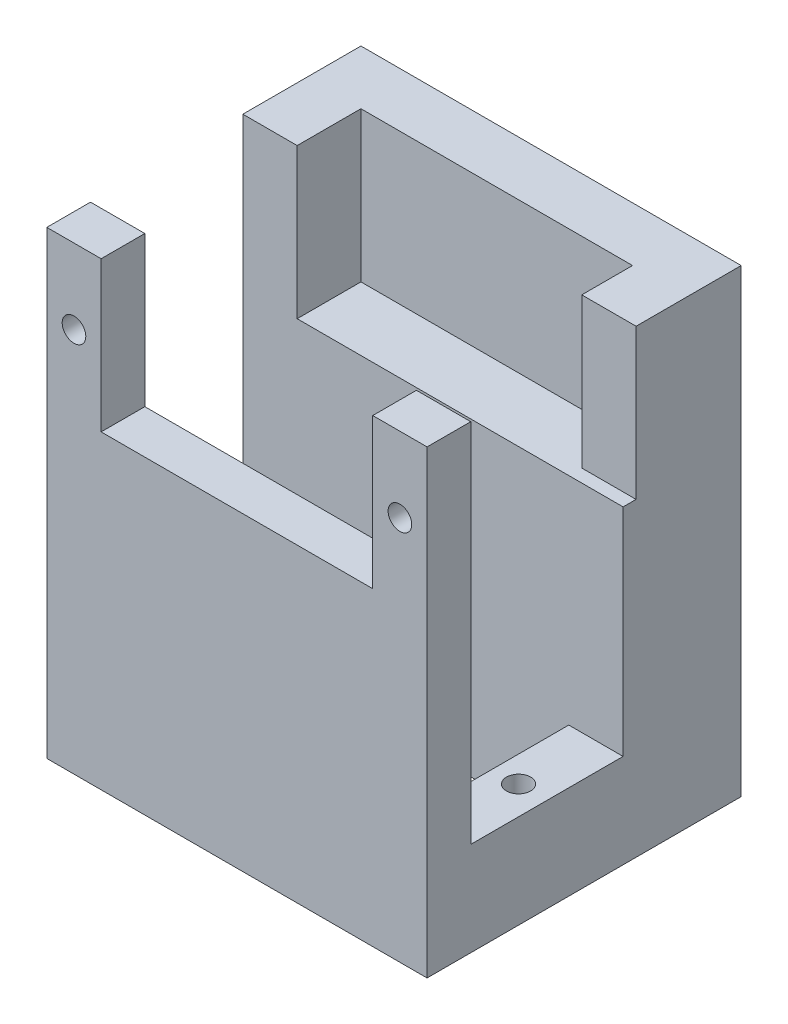
ISO-10303-21;
HEADER;
FILE_DESCRIPTION(('STEP AP214'),'2;1');
FILE_NAME('part.step','',(''),(''),'','','');
FILE_SCHEMA(('AUTOMOTIVE_DESIGN { 1 0 10303 214 1 1 1 1 }'));
ENDSEC;
DATA;
#1=APPLICATION_CONTEXT('core data for automotive mechanical design processes');
#2=APPLICATION_PROTOCOL_DEFINITION('international standard','automotive_design',2000,#1);
#3=PRODUCT_CONTEXT('',#1,'mechanical');
#4=PRODUCT('Part','Part','',(#3));
#5=PRODUCT_RELATED_PRODUCT_CATEGORY('part','',(#4));
#6=PRODUCT_DEFINITION_FORMATION('','',#4);
#7=PRODUCT_DEFINITION_CONTEXT('part definition',#1,'design');
#8=PRODUCT_DEFINITION('design','',#6,#7);
#9=PRODUCT_DEFINITION_SHAPE('','',#8);
#10=(LENGTH_UNIT() NAMED_UNIT(*) SI_UNIT(.MILLI.,.METRE.));
#11=(NAMED_UNIT(*) PLANE_ANGLE_UNIT() SI_UNIT($,.RADIAN.));
#12=(NAMED_UNIT(*) SI_UNIT($,.STERADIAN.) SOLID_ANGLE_UNIT());
#13=UNCERTAINTY_MEASURE_WITH_UNIT(LENGTH_MEASURE(1.E-05),#10,'distance_accuracy_value','');
#14=(GEOMETRIC_REPRESENTATION_CONTEXT(3) GLOBAL_UNCERTAINTY_ASSIGNED_CONTEXT((#13)) GLOBAL_UNIT_ASSIGNED_CONTEXT((#10,
#11,#12)) REPRESENTATION_CONTEXT('',''));
#15=CARTESIAN_POINT('',(0.,0.,0.));
#16=DIRECTION('',(0.,0.,1.));
#17=DIRECTION('',(1.,0.,0.));
#18=AXIS2_PLACEMENT_3D('',#15,#16,#17);
#19=CARTESIAN_POINT('',(0.,22.,0.));
#20=DIRECTION('',(0.,1.,0.));
#21=DIRECTION('',(0.,0.,1.));
#22=AXIS2_PLACEMENT_3D('',#19,#20,#21);
#23=PLANE('',#22);
#24=DIRECTION('',(1.,0.,0.));
#25=VECTOR('',#24,1.);
#26=CARTESIAN_POINT('',(-21.15,22.,10.15));
#27=LINE('',#26,#25);
#28=CARTESIAN_POINT('',(-16.55,22.,10.15));
#29=VERTEX_POINT('',#28);
#30=CARTESIAN_POINT('',(6.45,22.,10.15));
#31=VERTEX_POINT('',#30);
#32=EDGE_CURVE('E55',#29,#31,#27,.T.);
#33=ORIENTED_EDGE('',*,*,#32,.T.);
#34=DIRECTION('',(0.,0.,1.));
#35=VECTOR('',#34,1.);
#36=CARTESIAN_POINT('',(6.45,22.,10.15));
#37=LINE('',#36,#35);
#38=CARTESIAN_POINT('',(6.45,22.,6.45));
#39=VERTEX_POINT('',#38);
#40=EDGE_CURVE('E50',#39,#31,#37,.T.);
#41=ORIENTED_EDGE('',*,*,#40,.F.);
#42=DIRECTION('',(-1.,0.,0.));
#43=VECTOR('',#42,1.);
#44=CARTESIAN_POINT('',(-21.15,22.,6.45));
#45=LINE('',#44,#43);
#46=CARTESIAN_POINT('',(-16.55,22.,6.45));
#47=VERTEX_POINT('',#46);
#48=EDGE_CURVE('E293',#39,#47,#45,.T.);
#49=ORIENTED_EDGE('',*,*,#48,.T.);
#50=DIRECTION('',(0.,0.,-1.));
#51=VECTOR('',#50,1.);
#52=CARTESIAN_POINT('',(-16.55,22.,10.15));
#53=LINE('',#52,#51);
#54=EDGE_CURVE('E226',#29,#47,#53,.T.);
#55=ORIENTED_EDGE('',*,*,#54,.F.);
#56=EDGE_LOOP('',(#33,#41,#49,#55));
#57=FACE_BOUND('',#56,.T.);
#58=ADVANCED_FACE('F35',(#57),#23,.T.);
#59=CARTESIAN_POINT('',(0.,22.,0.));
#60=DIRECTION('',(0.,1.,0.));
#61=DIRECTION('',(0.,0.,1.));
#62=AXIS2_PLACEMENT_3D('',#59,#60,#61);
#63=PLANE('',#62);
#64=DIRECTION('',(1.,0.,0.));
#65=VECTOR('',#64,1.);
#66=CARTESIAN_POINT('',(-16.55,22.,-11.85));
#67=LINE('',#66,#65);
#68=CARTESIAN_POINT('',(-16.55,22.,-11.85));
#69=VERTEX_POINT('',#68);
#70=CARTESIAN_POINT('',(6.45,22.,-11.85));
#71=VERTEX_POINT('',#70);
#72=EDGE_CURVE('E269',#69,#71,#67,.T.);
#73=ORIENTED_EDGE('',*,*,#72,.F.);
#74=DIRECTION('',(0.,0.,-1.));
#75=VECTOR('',#74,1.);
#76=CARTESIAN_POINT('',(-16.55,22.,-11.85));
#77=LINE('',#76,#75);
#78=CARTESIAN_POINT('',(-16.55,22.,-6.45));
#79=VERTEX_POINT('',#78);
#80=EDGE_CURVE('E245',#79,#69,#77,.T.);
#81=ORIENTED_EDGE('',*,*,#80,.F.);
#82=DIRECTION('',(1.,0.,0.));
#83=VECTOR('',#82,1.);
#84=CARTESIAN_POINT('',(-21.15,22.,-6.45));
#85=LINE('',#84,#83);
#86=CARTESIAN_POINT('',(11.05,22.,-6.45));
#87=VERTEX_POINT('',#86);
#88=EDGE_CURVE('E298',#79,#87,#85,.T.);
#89=ORIENTED_EDGE('',*,*,#88,.T.);
#90=DIRECTION('',(0.,0.,-1.));
#91=VECTOR('',#90,1.);
#92=CARTESIAN_POINT('',(11.05,22.,-16.45));
#93=LINE('',#92,#91);
#94=CARTESIAN_POINT('',(11.05,22.,-7.55));
#95=VERTEX_POINT('',#94);
#96=EDGE_CURVE('E300',#87,#95,#93,.T.);
#97=ORIENTED_EDGE('',*,*,#96,.T.);
#98=DIRECTION('',(1.,0.,0.));
#99=VECTOR('',#98,1.);
#100=CARTESIAN_POINT('',(11.05,22.,-7.55));
#101=LINE('',#100,#99);
#102=CARTESIAN_POINT('',(6.45,22.,-7.55));
#103=VERTEX_POINT('',#102);
#104=EDGE_CURVE('E250',#103,#95,#101,.T.);
#105=ORIENTED_EDGE('',*,*,#104,.F.);
#106=DIRECTION('',(0.,0.,1.));
#107=VECTOR('',#106,1.);
#108=CARTESIAN_POINT('',(6.45,22.,-11.85));
#109=LINE('',#108,#107);
#110=EDGE_CURVE('E272',#71,#103,#109,.T.);
#111=ORIENTED_EDGE('',*,*,#110,.F.);
#112=EDGE_LOOP('',(#73,#81,#89,#97,#105,#111));
#113=FACE_BOUND('',#112,.T.);
#114=ADVANCED_FACE('F447',(#113),#63,.T.);
#115=CARTESIAN_POINT('',(0.,3.7,0.));
#116=DIRECTION('',(0.,1.,0.));
#117=DIRECTION('',(0.,0.,1.));
#118=AXIS2_PLACEMENT_3D('',#115,#116,#117);
#119=PLANE('',#118);
#120=CARTESIAN_POINT('',(-18.75,3.7,0.));
#121=DIRECTION('',(0.,1.,0.));
#122=DIRECTION('',(0.,0.,1.));
#123=AXIS2_PLACEMENT_3D('',#120,#121,#122);
#124=CIRCLE('',#123,1.025);
#125=CARTESIAN_POINT('',(-18.75,3.7,1.02500000000005));
#126=VERTEX_POINT('',#125);
#127=EDGE_CURVE('E314',#126,#126,#124,.T.);
#128=ORIENTED_EDGE('',*,*,#127,.F.);
#129=EDGE_LOOP('',(#128));
#130=FACE_BOUND('',#129,.T.);
#131=DIRECTION('',(0.,0.,1.));
#132=VECTOR('',#131,1.);
#133=CARTESIAN_POINT('',(-21.15,3.7,0.));
#134=LINE('',#133,#132);
#135=CARTESIAN_POINT('',(-21.15,3.7,-6.45));
#136=VERTEX_POINT('',#135);
#137=CARTESIAN_POINT('',(-21.15,3.7,6.45));
#138=VERTEX_POINT('',#137);
#139=EDGE_CURVE('E329',#136,#138,#134,.T.);
#140=ORIENTED_EDGE('',*,*,#139,.T.);
#141=DIRECTION('',(1.,0.,0.));
#142=VECTOR('',#141,1.);
#143=CARTESIAN_POINT('',(0.,3.7,6.45));
#144=LINE('',#143,#142);
#145=CARTESIAN_POINT('',(-16.55,3.7,6.45));
#146=VERTEX_POINT('',#145);
#147=EDGE_CURVE('E11',#138,#146,#144,.T.);
#148=ORIENTED_EDGE('',*,*,#147,.T.);
#149=DIRECTION('',(0.,0.,1.));
#150=VECTOR('',#149,1.);
#151=CARTESIAN_POINT('',(-16.55,3.7,0.));
#152=LINE('',#151,#150);
#153=CARTESIAN_POINT('',(-16.55,3.7,-6.45));
#154=VERTEX_POINT('',#153);
#155=EDGE_CURVE('E322',#154,#146,#152,.T.);
#156=ORIENTED_EDGE('',*,*,#155,.F.);
#157=DIRECTION('',(1.,0.,0.));
#158=VECTOR('',#157,1.);
#159=CARTESIAN_POINT('',(-21.15,3.7,-6.45));
#160=LINE('',#159,#158);
#161=EDGE_CURVE('E197',#136,#154,#160,.T.);
#162=ORIENTED_EDGE('',*,*,#161,.F.);
#163=EDGE_LOOP('',(#140,#148,#156,#162));
#164=FACE_BOUND('',#163,.T.);
#165=ADVANCED_FACE('F406',(#130,#164),#119,.T.);
#166=CARTESIAN_POINT('',(8.65,3.7,0.));
#167=DIRECTION('',(0.,1.,0.));
#168=DIRECTION('',(0.,0.,1.));
#169=AXIS2_PLACEMENT_3D('',#166,#167,#168);
#170=CIRCLE('',#169,1.025);
#171=CARTESIAN_POINT('',(8.65,3.7,1.02500000000005));
#172=VERTEX_POINT('',#171);
#173=EDGE_CURVE('E317',#172,#172,#170,.T.);
#174=ORIENTED_EDGE('',*,*,#173,.F.);
#175=EDGE_LOOP('',(#174));
#176=FACE_BOUND('',#175,.T.);
#177=DIRECTION('',(0.,0.,1.));
#178=VECTOR('',#177,1.);
#179=CARTESIAN_POINT('',(6.45,3.7,0.));
#180=LINE('',#179,#178);
#181=CARTESIAN_POINT('',(6.45,3.7,-6.45));
#182=VERTEX_POINT('',#181);
#183=CARTESIAN_POINT('',(6.45,3.7,6.45));
#184=VERTEX_POINT('',#183);
#185=EDGE_CURVE('E325',#182,#184,#180,.T.);
#186=ORIENTED_EDGE('',*,*,#185,.T.);
#187=DIRECTION('',(-1.,0.,0.));
#188=VECTOR('',#187,1.);
#189=CARTESIAN_POINT('',(-21.15,3.7,6.45));
#190=LINE('',#189,#188);
#191=CARTESIAN_POINT('',(11.05,3.7,6.45));
#192=VERTEX_POINT('',#191);
#193=EDGE_CURVE('E291',#192,#184,#190,.T.);
#194=ORIENTED_EDGE('',*,*,#193,.F.);
#195=DIRECTION('',(0.,0.,1.));
#196=VECTOR('',#195,1.);
#197=CARTESIAN_POINT('',(11.05,3.7,0.));
#198=LINE('',#197,#196);
#199=CARTESIAN_POINT('',(11.05,3.7,-6.45));
#200=VERTEX_POINT('',#199);
#201=EDGE_CURVE('E194',#200,#192,#198,.T.);
#202=ORIENTED_EDGE('',*,*,#201,.F.);
#203=EDGE_CURVE('E43',#182,#200,#160,.T.);
#204=ORIENTED_EDGE('',*,*,#203,.F.);
#205=EDGE_LOOP('',(#186,#194,#202,#204));
#206=FACE_BOUND('',#205,.T.);
#207=ADVANCED_FACE('F476',(#176,#206),#119,.T.);
#208=CARTESIAN_POINT('',(0.,0.,0.));
#209=DIRECTION('',(0.,1.,0.));
#210=DIRECTION('',(0.,0.,1.));
#211=AXIS2_PLACEMENT_3D('',#208,#209,#210);
#212=PLANE('',#211);
#213=DIRECTION('',(0.,0.,1.));
#214=VECTOR('',#213,1.);
#215=CARTESIAN_POINT('',(-16.55,0.,0.));
#216=LINE('',#215,#214);
#217=CARTESIAN_POINT('',(-16.55,0.,-6.45));
#218=VERTEX_POINT('',#217);
#219=CARTESIAN_POINT('',(-16.55,0.,6.45));
#220=VERTEX_POINT('',#219);
#221=EDGE_CURVE('E335',#218,#220,#216,.T.);
#222=ORIENTED_EDGE('',*,*,#221,.T.);
#223=DIRECTION('',(1.,0.,0.));
#224=VECTOR('',#223,1.);
#225=CARTESIAN_POINT('',(0.,0.,6.45));
#226=LINE('',#225,#224);
#227=CARTESIAN_POINT('',(-9.05,0.,6.45));
#228=VERTEX_POINT('',#227);
#229=EDGE_CURVE('E313',#220,#228,#226,.T.);
#230=ORIENTED_EDGE('',*,*,#229,.T.);
#231=DIRECTION('',(0.,0.,1.));
#232=VECTOR('',#231,1.);
#233=CARTESIAN_POINT('',(-9.05,0.,0.));
#234=LINE('',#233,#232);
#235=CARTESIAN_POINT('',(-9.05,0.,-6.45));
#236=VERTEX_POINT('',#235);
#237=EDGE_CURVE('E343',#236,#228,#234,.T.);
#238=ORIENTED_EDGE('',*,*,#237,.F.);
#239=DIRECTION('',(1.,0.,0.));
#240=VECTOR('',#239,1.);
#241=CARTESIAN_POINT('',(0.,0.,-6.45));
#242=LINE('',#241,#240);
#243=EDGE_CURVE('E326',#218,#236,#242,.T.);
#244=ORIENTED_EDGE('',*,*,#243,.F.);
#245=EDGE_LOOP('',(#222,#230,#238,#244));
#246=FACE_BOUND('',#245,.T.);
#247=ADVANCED_FACE('F395',(#246),#212,.T.);
#248=CARTESIAN_POINT('',(-21.15,-4.25,0.));
#249=DIRECTION('',(-1.,0.,0.));
#250=DIRECTION('',(0.,0.,1.));
#251=AXIS2_PLACEMENT_3D('',#248,#249,#250);
#252=PLANE('',#251);
#253=DIRECTION('',(0.,1.,0.));
#254=VECTOR('',#253,1.);
#255=CARTESIAN_POINT('',(-21.15,-4.25,10.15));
#256=LINE('',#255,#254);
#257=CARTESIAN_POINT('',(-21.15,-4.25,10.15));
#258=VERTEX_POINT('',#257);
#259=CARTESIAN_POINT('',(-21.15,34.7,10.15));
#260=VERTEX_POINT('',#259);
#261=EDGE_CURVE('E374',#258,#260,#256,.T.);
#262=ORIENTED_EDGE('',*,*,#261,.T.);
#263=DIRECTION('',(0.,0.,1.));
#264=VECTOR('',#263,1.);
#265=CARTESIAN_POINT('',(-21.15,34.7,10.15));
#266=LINE('',#265,#264);
#267=CARTESIAN_POINT('',(-21.15,34.7,6.45));
#268=VERTEX_POINT('',#267);
#269=EDGE_CURVE('E227',#268,#260,#266,.T.);
#270=ORIENTED_EDGE('',*,*,#269,.F.);
#271=DIRECTION('',(0.,-1.,0.));
#272=VECTOR('',#271,1.);
#273=CARTESIAN_POINT('',(-21.15,22.,6.45));
#274=LINE('',#273,#272);
#275=EDGE_CURVE('E198',#268,#138,#274,.T.);
#276=ORIENTED_EDGE('',*,*,#275,.T.);
#277=ORIENTED_EDGE('',*,*,#139,.F.);
#278=DIRECTION('',(0.,-1.,0.));
#279=VECTOR('',#278,1.);
#280=CARTESIAN_POINT('',(-21.15,22.,-6.45));
#281=LINE('',#280,#279);
#282=CARTESIAN_POINT('',(-21.15,34.7,-6.45));
#283=VERTEX_POINT('',#282);
#284=EDGE_CURVE('E306',#283,#136,#281,.T.);
#285=ORIENTED_EDGE('',*,*,#284,.F.);
#286=DIRECTION('',(0.,0.,1.));
#287=VECTOR('',#286,1.);
#288=CARTESIAN_POINT('',(-21.15,34.7,-16.45));
#289=LINE('',#288,#287);
#290=CARTESIAN_POINT('',(-21.15,34.7,-16.45));
#291=VERTEX_POINT('',#290);
#292=EDGE_CURVE('E246',#291,#283,#289,.T.);
#293=ORIENTED_EDGE('',*,*,#292,.F.);
#294=DIRECTION('',(0.,1.,0.));
#295=VECTOR('',#294,1.);
#296=CARTESIAN_POINT('',(-21.15,-4.25,-16.45));
#297=LINE('',#296,#295);
#298=CARTESIAN_POINT('',(-21.15,-4.25,-16.45));
#299=VERTEX_POINT('',#298);
#300=EDGE_CURVE('E368',#299,#291,#297,.T.);
#301=ORIENTED_EDGE('',*,*,#300,.F.);
#302=DIRECTION('',(0.,0.,1.));
#303=VECTOR('',#302,1.);
#304=CARTESIAN_POINT('',(-21.15,-4.25,0.));
#305=LINE('',#304,#303);
#306=EDGE_CURVE('E354',#299,#258,#305,.T.);
#307=ORIENTED_EDGE('',*,*,#306,.T.);
#308=EDGE_LOOP('',(#262,#270,#276,#277,#285,#293,#301,#307));
#309=FACE_BOUND('',#308,.T.);
#310=ADVANCED_FACE('F405',(#309),#252,.T.);
#311=CARTESIAN_POINT('',(0.,-4.25,-16.45));
#312=DIRECTION('',(0.,0.,1.));
#313=DIRECTION('',(1.,0.,0.));
#314=AXIS2_PLACEMENT_3D('',#311,#312,#313);
#315=PLANE('',#314);
#316=ORIENTED_EDGE('',*,*,#300,.T.);
#317=DIRECTION('',(-1.,0.,0.));
#318=VECTOR('',#317,1.);
#319=CARTESIAN_POINT('',(11.05,34.7,-16.45));
#320=LINE('',#319,#318);
#321=CARTESIAN_POINT('',(11.05,34.7,-16.45));
#322=VERTEX_POINT('',#321);
#323=EDGE_CURVE('E263',#322,#291,#320,.T.);
#324=ORIENTED_EDGE('',*,*,#323,.F.);
#325=DIRECTION('',(0.,1.,0.));
#326=VECTOR('',#325,1.);
#327=CARTESIAN_POINT('',(11.05,-4.25,-16.45));
#328=LINE('',#327,#326);
#329=CARTESIAN_POINT('',(11.05,-4.25,-16.45));
#330=VERTEX_POINT('',#329);
#331=EDGE_CURVE('E370',#330,#322,#328,.T.);
#332=ORIENTED_EDGE('',*,*,#331,.F.);
#333=DIRECTION('',(1.,0.,0.));
#334=VECTOR('',#333,1.);
#335=CARTESIAN_POINT('',(0.,-4.25,-16.45));
#336=LINE('',#335,#334);
#337=EDGE_CURVE('E362',#299,#330,#336,.T.);
#338=ORIENTED_EDGE('',*,*,#337,.F.);
#339=EDGE_LOOP('',(#316,#324,#332,#338));
#340=FACE_BOUND('',#339,.T.);
#341=ADVANCED_FACE('F419',(#340),#315,.F.);
#342=CARTESIAN_POINT('',(11.05,-4.25,0.));
#343=DIRECTION('',(-1.,0.,0.));
#344=DIRECTION('',(0.,0.,1.));
#345=AXIS2_PLACEMENT_3D('',#342,#343,#344);
#346=PLANE('',#345);
#347=ORIENTED_EDGE('',*,*,#331,.T.);
#348=DIRECTION('',(0.,0.,-1.));
#349=VECTOR('',#348,1.);
#350=CARTESIAN_POINT('',(11.05,34.7,-16.45));
#351=LINE('',#350,#349);
#352=CARTESIAN_POINT('',(11.05,34.7,-7.55));
#353=VERTEX_POINT('',#352);
#354=EDGE_CURVE('E260',#353,#322,#351,.T.);
#355=ORIENTED_EDGE('',*,*,#354,.F.);
#356=DIRECTION('',(0.,-1.,0.));
#357=VECTOR('',#356,1.);
#358=CARTESIAN_POINT('',(11.05,34.7,-7.55));
#359=LINE('',#358,#357);
#360=EDGE_CURVE('E266',#353,#95,#359,.T.);
#361=ORIENTED_EDGE('',*,*,#360,.T.);
#362=ORIENTED_EDGE('',*,*,#96,.F.);
#363=DIRECTION('',(0.,-1.,0.));
#364=VECTOR('',#363,1.);
#365=CARTESIAN_POINT('',(11.05,22.,-6.45));
#366=LINE('',#365,#364);
#367=EDGE_CURVE('E302',#87,#200,#366,.T.);
#368=ORIENTED_EDGE('',*,*,#367,.T.);
#369=ORIENTED_EDGE('',*,*,#201,.T.);
#370=DIRECTION('',(0.,-1.,0.));
#371=VECTOR('',#370,1.);
#372=CARTESIAN_POINT('',(11.05,22.,6.45));
#373=LINE('',#372,#371);
#374=CARTESIAN_POINT('',(11.05,34.7,6.45));
#375=VERTEX_POINT('',#374);
#376=EDGE_CURVE('E187',#375,#192,#373,.T.);
#377=ORIENTED_EDGE('',*,*,#376,.F.);
#378=DIRECTION('',(0.,0.,-1.));
#379=VECTOR('',#378,1.);
#380=CARTESIAN_POINT('',(11.05,34.7,10.15));
#381=LINE('',#380,#379);
#382=CARTESIAN_POINT('',(11.05,34.7,10.15));
#383=VERTEX_POINT('',#382);
#384=EDGE_CURVE('E192',#383,#375,#381,.T.);
#385=ORIENTED_EDGE('',*,*,#384,.F.);
#386=DIRECTION('',(0.,1.,0.));
#387=VECTOR('',#386,1.);
#388=CARTESIAN_POINT('',(11.05,-4.25,10.15));
#389=LINE('',#388,#387);
#390=CARTESIAN_POINT('',(11.05,-4.25,10.15));
#391=VERTEX_POINT('',#390);
#392=EDGE_CURVE('E372',#391,#383,#389,.T.);
#393=ORIENTED_EDGE('',*,*,#392,.F.);
#394=DIRECTION('',(0.,0.,1.));
#395=VECTOR('',#394,1.);
#396=CARTESIAN_POINT('',(11.05,-4.25,0.));
#397=LINE('',#396,#395);
#398=EDGE_CURVE('E360',#330,#391,#397,.T.);
#399=ORIENTED_EDGE('',*,*,#398,.F.);
#400=EDGE_LOOP('',(#347,#355,#361,#362,#368,#369,#377,#385,#393,#399));
#401=FACE_BOUND('',#400,.T.);
#402=ADVANCED_FACE('F189',(#401),#346,.F.);
#403=CARTESIAN_POINT('',(0.,-4.25,6.45));
#404=DIRECTION('',(0.,0.,1.));
#405=DIRECTION('',(1.,0.,0.));
#406=AXIS2_PLACEMENT_3D('',#403,#404,#405);
#407=PLANE('',#406);
#408=CARTESIAN_POINT('',(-18.85,28.35,6.45));
#409=DIRECTION('',(0.,0.,1.));
#410=DIRECTION('',(1.,0.,0.));
#411=AXIS2_PLACEMENT_3D('',#408,#409,#410);
#412=CIRCLE('',#411,1.);
#413=CARTESIAN_POINT('',(-17.85,28.35,6.45));
#414=VERTEX_POINT('',#413);
#415=EDGE_CURVE('E214',#414,#414,#412,.F.);
#416=ORIENTED_EDGE('',*,*,#415,.F.);
#417=EDGE_LOOP('',(#416));
#418=FACE_BOUND('',#417,.T.);
#419=CARTESIAN_POINT('',(8.75,28.35,6.45));
#420=DIRECTION('',(0.,0.,1.));
#421=DIRECTION('',(1.,0.,0.));
#422=AXIS2_PLACEMENT_3D('',#419,#420,#421);
#423=CIRCLE('',#422,1.);
#424=CARTESIAN_POINT('',(9.75,28.35,6.45));
#425=VERTEX_POINT('',#424);
#426=EDGE_CURVE('E217',#425,#425,#423,.F.);
#427=ORIENTED_EDGE('',*,*,#426,.F.);
#428=EDGE_LOOP('',(#427));
#429=FACE_BOUND('',#428,.T.);
#430=DIRECTION('',(0.,1.,0.));
#431=VECTOR('',#430,1.);
#432=CARTESIAN_POINT('',(-9.05,-4.25,6.45));
#433=LINE('',#432,#431);
#434=CARTESIAN_POINT('',(-9.05,-4.25,6.45));
#435=VERTEX_POINT('',#434);
#436=EDGE_CURVE('E365',#435,#228,#433,.T.);
#437=ORIENTED_EDGE('',*,*,#436,.T.);
#438=ORIENTED_EDGE('',*,*,#229,.F.);
#439=DIRECTION('',(0.,-1.,0.));
#440=VECTOR('',#439,1.);
#441=CARTESIAN_POINT('',(-16.55,3.7,6.45));
#442=LINE('',#441,#440);
#443=EDGE_CURVE('E340',#146,#220,#442,.T.);
#444=ORIENTED_EDGE('',*,*,#443,.F.);
#445=ORIENTED_EDGE('',*,*,#147,.F.);
#446=ORIENTED_EDGE('',*,*,#275,.F.);
#447=DIRECTION('',(-1.,0.,0.));
#448=VECTOR('',#447,1.);
#449=CARTESIAN_POINT('',(-21.15,34.7,6.45));
#450=LINE('',#449,#448);
#451=CARTESIAN_POINT('',(-16.55,34.7,6.45));
#452=VERTEX_POINT('',#451);
#453=EDGE_CURVE('E234',#452,#268,#450,.T.);
#454=ORIENTED_EDGE('',*,*,#453,.F.);
#455=DIRECTION('',(0.,-1.,0.));
#456=VECTOR('',#455,1.);
#457=CARTESIAN_POINT('',(-16.55,34.7,6.45));
#458=LINE('',#457,#456);
#459=EDGE_CURVE('E237',#452,#47,#458,.T.);
#460=ORIENTED_EDGE('',*,*,#459,.T.);
#461=ORIENTED_EDGE('',*,*,#48,.F.);
#462=DIRECTION('',(0.,-1.,0.));
#463=VECTOR('',#462,1.);
#464=CARTESIAN_POINT('',(6.45,34.7,6.45));
#465=LINE('',#464,#463);
#466=CARTESIAN_POINT('',(6.45,34.7,6.45));
#467=VERTEX_POINT('',#466);
#468=EDGE_CURVE('E204',#467,#39,#465,.T.);
#469=ORIENTED_EDGE('',*,*,#468,.F.);
#470=DIRECTION('',(-1.,0.,0.));
#471=VECTOR('',#470,1.);
#472=CARTESIAN_POINT('',(11.05,34.7,6.45));
#473=LINE('',#472,#471);
#474=EDGE_CURVE('E201',#375,#467,#473,.T.);
#475=ORIENTED_EDGE('',*,*,#474,.F.);
#476=ORIENTED_EDGE('',*,*,#376,.T.);
#477=ORIENTED_EDGE('',*,*,#193,.T.);
#478=DIRECTION('',(0.,1.,0.));
#479=VECTOR('',#478,1.);
#480=CARTESIAN_POINT('',(6.45,-4.25,6.45));
#481=LINE('',#480,#479);
#482=CARTESIAN_POINT('',(6.45,-4.25,6.45));
#483=VERTEX_POINT('',#482);
#484=EDGE_CURVE('E376',#483,#184,#481,.T.);
#485=ORIENTED_EDGE('',*,*,#484,.F.);
#486=DIRECTION('',(1.,0.,0.));
#487=VECTOR('',#486,1.);
#488=CARTESIAN_POINT('',(0.,-4.25,6.45));
#489=LINE('',#488,#487);
#490=EDGE_CURVE('E344',#435,#483,#489,.T.);
#491=ORIENTED_EDGE('',*,*,#490,.F.);
#492=EDGE_LOOP('',(#437,#438,#444,#445,#446,#454,#460,#461,#469,#475,#476,#477,#485,#491));
#493=FACE_BOUND('',#492,.T.);
#494=ADVANCED_FACE('F37',(#418,#429,#493),#407,.F.);
#495=CARTESIAN_POINT('',(6.45,-4.25,0.));
#496=DIRECTION('',(-1.,0.,0.));
#497=DIRECTION('',(0.,0.,1.));
#498=AXIS2_PLACEMENT_3D('',#495,#496,#497);
#499=PLANE('',#498);
#500=ORIENTED_EDGE('',*,*,#484,.T.);
#501=ORIENTED_EDGE('',*,*,#185,.F.);
#502=DIRECTION('',(0.,1.,0.));
#503=VECTOR('',#502,1.);
#504=CARTESIAN_POINT('',(6.45,-4.25,-6.45));
#505=LINE('',#504,#503);
#506=CARTESIAN_POINT('',(6.45,-4.25,-6.45));
#507=VERTEX_POINT('',#506);
#508=EDGE_CURVE('E379',#507,#182,#505,.T.);
#509=ORIENTED_EDGE('',*,*,#508,.F.);
#510=DIRECTION('',(0.,0.,1.));
#511=VECTOR('',#510,1.);
#512=CARTESIAN_POINT('',(6.45,-4.25,0.));
#513=LINE('',#512,#511);
#514=EDGE_CURVE('E351',#507,#483,#513,.T.);
#515=ORIENTED_EDGE('',*,*,#514,.T.);
#516=EDGE_LOOP('',(#500,#501,#509,#515));
#517=FACE_BOUND('',#516,.T.);
#518=ADVANCED_FACE('F494',(#517),#499,.T.);
#519=CARTESIAN_POINT('',(0.,-4.25,-6.45));
#520=DIRECTION('',(0.,0.,1.));
#521=DIRECTION('',(1.,0.,0.));
#522=AXIS2_PLACEMENT_3D('',#519,#520,#521);
#523=PLANE('',#522);
#524=ORIENTED_EDGE('',*,*,#508,.T.);
#525=ORIENTED_EDGE('',*,*,#203,.T.);
#526=ORIENTED_EDGE('',*,*,#367,.F.);
#527=ORIENTED_EDGE('',*,*,#88,.F.);
#528=DIRECTION('',(0.,-1.,0.));
#529=VECTOR('',#528,1.);
#530=CARTESIAN_POINT('',(-16.55,34.7,-6.45));
#531=LINE('',#530,#529);
#532=CARTESIAN_POINT('',(-16.55,34.7,-6.45));
#533=VERTEX_POINT('',#532);
#534=EDGE_CURVE('E288',#533,#79,#531,.T.);
#535=ORIENTED_EDGE('',*,*,#534,.F.);
#536=DIRECTION('',(1.,0.,0.));
#537=VECTOR('',#536,1.);
#538=CARTESIAN_POINT('',(-21.15,34.7,-6.45));
#539=LINE('',#538,#537);
#540=EDGE_CURVE('E249',#283,#533,#539,.T.);
#541=ORIENTED_EDGE('',*,*,#540,.F.);
#542=ORIENTED_EDGE('',*,*,#284,.T.);
#543=ORIENTED_EDGE('',*,*,#161,.T.);
#544=DIRECTION('',(0.,-1.,0.));
#545=VECTOR('',#544,1.);
#546=CARTESIAN_POINT('',(-16.55,3.7,-6.45));
#547=LINE('',#546,#545);
#548=EDGE_CURVE('E333',#154,#218,#547,.T.);
#549=ORIENTED_EDGE('',*,*,#548,.T.);
#550=ORIENTED_EDGE('',*,*,#243,.T.);
#551=DIRECTION('',(0.,1.,0.));
#552=VECTOR('',#551,1.);
#553=CARTESIAN_POINT('',(-9.05,-4.25,-6.45));
#554=LINE('',#553,#552);
#555=CARTESIAN_POINT('',(-9.05,-4.25,-6.45));
#556=VERTEX_POINT('',#555);
#557=EDGE_CURVE('E382',#556,#236,#554,.T.);
#558=ORIENTED_EDGE('',*,*,#557,.F.);
#559=DIRECTION('',(1.,0.,0.));
#560=VECTOR('',#559,1.);
#561=CARTESIAN_POINT('',(0.,-4.25,-6.45));
#562=LINE('',#561,#560);
#563=EDGE_CURVE('E348',#556,#507,#562,.T.);
#564=ORIENTED_EDGE('',*,*,#563,.T.);
#565=EDGE_LOOP('',(#524,#525,#526,#527,#535,#541,#542,#543,#549,#550,#558,#564));
#566=FACE_BOUND('',#565,.T.);
#567=ADVANCED_FACE('F408',(#566),#523,.T.);
#568=CARTESIAN_POINT('',(-9.05,-4.25,0.));
#569=DIRECTION('',(-1.,0.,0.));
#570=DIRECTION('',(0.,0.,1.));
#571=AXIS2_PLACEMENT_3D('',#568,#569,#570);
#572=PLANE('',#571);
#573=ORIENTED_EDGE('',*,*,#237,.T.);
#574=ORIENTED_EDGE('',*,*,#436,.F.);
#575=DIRECTION('',(0.,0.,1.));
#576=VECTOR('',#575,1.);
#577=CARTESIAN_POINT('',(-9.05,-4.25,0.));
#578=LINE('',#577,#576);
#579=EDGE_CURVE('E346',#556,#435,#578,.T.);
#580=ORIENTED_EDGE('',*,*,#579,.F.);
#581=ORIENTED_EDGE('',*,*,#557,.T.);
#582=EDGE_LOOP('',(#573,#574,#580,#581));
#583=FACE_BOUND('',#582,.T.);
#584=ADVANCED_FACE('F390',(#583),#572,.F.);
#585=CARTESIAN_POINT('',(0.,-4.25,10.15));
#586=DIRECTION('',(0.,0.,1.));
#587=DIRECTION('',(1.,0.,0.));
#588=AXIS2_PLACEMENT_3D('',#585,#586,#587);
#589=PLANE('',#588);
#590=CARTESIAN_POINT('',(-18.85,28.35,10.15));
#591=DIRECTION('',(0.,0.,1.));
#592=DIRECTION('',(1.,0.,0.));
#593=AXIS2_PLACEMENT_3D('',#590,#591,#592);
#594=CIRCLE('',#593,1.);
#595=CARTESIAN_POINT('',(-17.85,28.35,10.15));
#596=VERTEX_POINT('',#595);
#597=EDGE_CURVE('E816',#596,#596,#594,.T.);
#598=ORIENTED_EDGE('',*,*,#597,.F.);
#599=EDGE_LOOP('',(#598));
#600=FACE_BOUND('',#599,.T.);
#601=CARTESIAN_POINT('',(8.75,28.35,10.15));
#602=DIRECTION('',(0.,0.,1.));
#603=DIRECTION('',(1.,0.,0.));
#604=AXIS2_PLACEMENT_3D('',#601,#602,#603);
#605=CIRCLE('',#604,1.);
#606=CARTESIAN_POINT('',(9.75,28.35,10.15));
#607=VERTEX_POINT('',#606);
#608=EDGE_CURVE('E817',#607,#607,#605,.T.);
#609=ORIENTED_EDGE('',*,*,#608,.F.);
#610=EDGE_LOOP('',(#609));
#611=FACE_BOUND('',#610,.T.);
#612=ORIENTED_EDGE('',*,*,#392,.T.);
#613=DIRECTION('',(1.,0.,0.));
#614=VECTOR('',#613,1.);
#615=CARTESIAN_POINT('',(11.05,34.7,10.15));
#616=LINE('',#615,#614);
#617=CARTESIAN_POINT('',(6.45,34.7,10.15));
#618=VERTEX_POINT('',#617);
#619=EDGE_CURVE('E212',#618,#383,#616,.T.);
#620=ORIENTED_EDGE('',*,*,#619,.F.);
#621=DIRECTION('',(0.,-1.,0.));
#622=VECTOR('',#621,1.);
#623=CARTESIAN_POINT('',(6.45,34.7,10.15));
#624=LINE('',#623,#622);
#625=EDGE_CURVE('E221',#618,#31,#624,.T.);
#626=ORIENTED_EDGE('',*,*,#625,.T.);
#627=ORIENTED_EDGE('',*,*,#32,.F.);
#628=DIRECTION('',(0.,-1.,0.));
#629=VECTOR('',#628,1.);
#630=CARTESIAN_POINT('',(-16.55,34.7,10.15));
#631=LINE('',#630,#629);
#632=CARTESIAN_POINT('',(-16.55,34.7,10.15));
#633=VERTEX_POINT('',#632);
#634=EDGE_CURVE('E242',#633,#29,#631,.T.);
#635=ORIENTED_EDGE('',*,*,#634,.F.);
#636=DIRECTION('',(1.,0.,0.));
#637=VECTOR('',#636,1.);
#638=CARTESIAN_POINT('',(-21.15,34.7,10.15));
#639=LINE('',#638,#637);
#640=EDGE_CURVE('E230',#260,#633,#639,.T.);
#641=ORIENTED_EDGE('',*,*,#640,.F.);
#642=ORIENTED_EDGE('',*,*,#261,.F.);
#643=DIRECTION('',(1.,0.,0.));
#644=VECTOR('',#643,1.);
#645=CARTESIAN_POINT('',(0.,-4.25,10.15));
#646=LINE('',#645,#644);
#647=EDGE_CURVE('E357',#258,#391,#646,.T.);
#648=ORIENTED_EDGE('',*,*,#647,.T.);
#649=EDGE_LOOP('',(#612,#620,#626,#627,#635,#641,#642,#648));
#650=FACE_BOUND('',#649,.T.);
#651=ADVANCED_FACE('F427',(#600,#611,#650),#589,.T.);
#652=CARTESIAN_POINT('',(0.,-4.25,0.));
#653=DIRECTION('',(0.,1.,0.));
#654=DIRECTION('',(0.,0.,1.));
#655=AXIS2_PLACEMENT_3D('',#652,#653,#654);
#656=PLANE('',#655);
#657=ORIENTED_EDGE('',*,*,#490,.T.);
#658=ORIENTED_EDGE('',*,*,#514,.F.);
#659=ORIENTED_EDGE('',*,*,#563,.F.);
#660=ORIENTED_EDGE('',*,*,#579,.T.);
#661=EDGE_LOOP('',(#657,#658,#659,#660));
#662=FACE_BOUND('',#661,.T.);
#663=ORIENTED_EDGE('',*,*,#306,.F.);
#664=ORIENTED_EDGE('',*,*,#337,.T.);
#665=ORIENTED_EDGE('',*,*,#398,.T.);
#666=ORIENTED_EDGE('',*,*,#647,.F.);
#667=EDGE_LOOP('',(#663,#664,#665,#666));
#668=FACE_BOUND('',#667,.T.);
#669=ADVANCED_FACE('F423',(#662,#668),#656,.F.);
#670=CARTESIAN_POINT('',(-16.55,3.7,0.));
#671=DIRECTION('',(1.,0.,0.));
#672=DIRECTION('',(0.,0.,-1.));
#673=AXIS2_PLACEMENT_3D('',#670,#671,#672);
#674=PLANE('',#673);
#675=ORIENTED_EDGE('',*,*,#221,.F.);
#676=ORIENTED_EDGE('',*,*,#548,.F.);
#677=ORIENTED_EDGE('',*,*,#155,.T.);
#678=ORIENTED_EDGE('',*,*,#443,.T.);
#679=EDGE_LOOP('',(#675,#676,#677,#678));
#680=FACE_BOUND('',#679,.T.);
#681=ADVANCED_FACE('F398',(#680),#674,.T.);
#682=CARTESIAN_POINT('',(8.65,-1.3,0.));
#683=DIRECTION('',(0.,1.,0.));
#684=DIRECTION('',(0.,0.,1.));
#685=AXIS2_PLACEMENT_3D('',#682,#683,#684);
#686=CYLINDRICAL_SURFACE('',#685,1.025);
#687=CARTESIAN_POINT('',(8.65,-1.3,0.));
#688=DIRECTION('',(0.,1.,0.));
#689=DIRECTION('',(0.,0.,1.));
#690=AXIS2_PLACEMENT_3D('',#687,#688,#689);
#691=CIRCLE('',#690,1.025);
#692=CARTESIAN_POINT('',(8.65,-1.3,1.02500000000005));
#693=VERTEX_POINT('',#692);
#694=EDGE_CURVE('E309',#693,#693,#691,.T.);
#695=ORIENTED_EDGE('',*,*,#694,.F.);
#696=EDGE_LOOP('',(#695));
#697=FACE_BOUND('',#696,.T.);
#698=ORIENTED_EDGE('',*,*,#173,.T.);
#699=EDGE_LOOP('',(#698));
#700=FACE_BOUND('',#699,.T.);
#701=ADVANCED_FACE('F467',(#697,#700),#686,.F.);
#702=CARTESIAN_POINT('',(0.,-1.3,0.));
#703=DIRECTION('',(0.,1.,0.));
#704=DIRECTION('',(0.,0.,1.));
#705=AXIS2_PLACEMENT_3D('',#702,#703,#704);
#706=PLANE('',#705);
#707=ORIENTED_EDGE('',*,*,#694,.T.);
#708=EDGE_LOOP('',(#707));
#709=FACE_BOUND('',#708,.T.);
#710=ADVANCED_FACE('F465',(#709),#706,.T.);
#711=CARTESIAN_POINT('',(-18.75,-1.3,0.));
#712=DIRECTION('',(0.,1.,0.));
#713=DIRECTION('',(0.,0.,1.));
#714=AXIS2_PLACEMENT_3D('',#711,#712,#713);
#715=CYLINDRICAL_SURFACE('',#714,1.025);
#716=CARTESIAN_POINT('',(-18.75,-1.3,0.));
#717=DIRECTION('',(0.,1.,0.));
#718=DIRECTION('',(0.,0.,1.));
#719=AXIS2_PLACEMENT_3D('',#716,#717,#718);
#720=CIRCLE('',#719,1.025);
#721=CARTESIAN_POINT('',(-18.75,-1.3,1.02500000000005));
#722=VERTEX_POINT('',#721);
#723=EDGE_CURVE('E310',#722,#722,#720,.T.);
#724=ORIENTED_EDGE('',*,*,#723,.F.);
#725=EDGE_LOOP('',(#724));
#726=FACE_BOUND('',#725,.T.);
#727=ORIENTED_EDGE('',*,*,#127,.T.);
#728=EDGE_LOOP('',(#727));
#729=FACE_BOUND('',#728,.T.);
#730=ADVANCED_FACE('F461',(#726,#729),#715,.F.);
#731=CARTESIAN_POINT('',(0.,-1.3,0.));
#732=DIRECTION('',(0.,1.,0.));
#733=DIRECTION('',(0.,0.,1.));
#734=AXIS2_PLACEMENT_3D('',#731,#732,#733);
#735=PLANE('',#734);
#736=ORIENTED_EDGE('',*,*,#723,.T.);
#737=EDGE_LOOP('',(#736));
#738=FACE_BOUND('',#737,.T.);
#739=ADVANCED_FACE('F458',(#738),#735,.T.);
#740=CARTESIAN_POINT('',(-16.55,34.7,-11.85));
#741=DIRECTION('',(-1.,0.,0.));
#742=DIRECTION('',(0.,0.,1.));
#743=AXIS2_PLACEMENT_3D('',#740,#741,#742);
#744=PLANE('',#743);
#745=ORIENTED_EDGE('',*,*,#80,.T.);
#746=DIRECTION('',(0.,-1.,0.));
#747=VECTOR('',#746,1.);
#748=CARTESIAN_POINT('',(-16.55,34.7,-11.85));
#749=LINE('',#748,#747);
#750=CARTESIAN_POINT('',(-16.55,34.7,-11.85));
#751=VERTEX_POINT('',#750);
#752=EDGE_CURVE('E285',#751,#69,#749,.T.);
#753=ORIENTED_EDGE('',*,*,#752,.F.);
#754=DIRECTION('',(0.,0.,-1.));
#755=VECTOR('',#754,1.);
#756=CARTESIAN_POINT('',(-16.55,34.7,-11.85));
#757=LINE('',#756,#755);
#758=EDGE_CURVE('E252',#533,#751,#757,.T.);
#759=ORIENTED_EDGE('',*,*,#758,.F.);
#760=ORIENTED_EDGE('',*,*,#534,.T.);
#761=EDGE_LOOP('',(#745,#753,#759,#760));
#762=FACE_BOUND('',#761,.T.);
#763=ADVANCED_FACE('F455',(#762),#744,.F.);
#764=CARTESIAN_POINT('',(-16.55,34.7,-11.85));
#765=DIRECTION('',(0.,0.,-1.));
#766=DIRECTION('',(-1.,0.,0.));
#767=AXIS2_PLACEMENT_3D('',#764,#765,#766);
#768=PLANE('',#767);
#769=ORIENTED_EDGE('',*,*,#72,.T.);
#770=DIRECTION('',(0.,-1.,0.));
#771=VECTOR('',#770,1.);
#772=CARTESIAN_POINT('',(6.45,34.7,-11.85));
#773=LINE('',#772,#771);
#774=CARTESIAN_POINT('',(6.45,34.7,-11.85));
#775=VERTEX_POINT('',#774);
#776=EDGE_CURVE('E282',#775,#71,#773,.T.);
#777=ORIENTED_EDGE('',*,*,#776,.F.);
#778=DIRECTION('',(1.,0.,0.));
#779=VECTOR('',#778,1.);
#780=CARTESIAN_POINT('',(-16.55,34.7,-11.85));
#781=LINE('',#780,#779);
#782=EDGE_CURVE('E254',#751,#775,#781,.T.);
#783=ORIENTED_EDGE('',*,*,#782,.F.);
#784=ORIENTED_EDGE('',*,*,#752,.T.);
#785=EDGE_LOOP('',(#769,#777,#783,#784));
#786=FACE_BOUND('',#785,.T.);
#787=ADVANCED_FACE('F543',(#786),#768,.F.);
#788=CARTESIAN_POINT('',(6.45,34.7,-11.85));
#789=DIRECTION('',(1.,0.,0.));
#790=DIRECTION('',(0.,0.,-1.));
#791=AXIS2_PLACEMENT_3D('',#788,#789,#790);
#792=PLANE('',#791);
#793=ORIENTED_EDGE('',*,*,#110,.T.);
#794=DIRECTION('',(0.,-1.,0.));
#795=VECTOR('',#794,1.);
#796=CARTESIAN_POINT('',(6.45,34.7,-7.55));
#797=LINE('',#796,#795);
#798=CARTESIAN_POINT('',(6.45,34.7,-7.55));
#799=VERTEX_POINT('',#798);
#800=EDGE_CURVE('E279',#799,#103,#797,.T.);
#801=ORIENTED_EDGE('',*,*,#800,.F.);
#802=DIRECTION('',(0.,0.,1.));
#803=VECTOR('',#802,1.);
#804=CARTESIAN_POINT('',(6.45,34.7,-11.85));
#805=LINE('',#804,#803);
#806=EDGE_CURVE('E256',#775,#799,#805,.T.);
#807=ORIENTED_EDGE('',*,*,#806,.F.);
#808=ORIENTED_EDGE('',*,*,#776,.T.);
#809=EDGE_LOOP('',(#793,#801,#807,#808));
#810=FACE_BOUND('',#809,.T.);
#811=ADVANCED_FACE('F550',(#810),#792,.F.);
#812=CARTESIAN_POINT('',(11.05,34.7,-7.55));
#813=DIRECTION('',(0.,0.,-1.));
#814=DIRECTION('',(-1.,0.,0.));
#815=AXIS2_PLACEMENT_3D('',#812,#813,#814);
#816=PLANE('',#815);
#817=ORIENTED_EDGE('',*,*,#104,.T.);
#818=ORIENTED_EDGE('',*,*,#360,.F.);
#819=DIRECTION('',(1.,0.,0.));
#820=VECTOR('',#819,1.);
#821=CARTESIAN_POINT('',(11.05,34.7,-7.55));
#822=LINE('',#821,#820);
#823=EDGE_CURVE('E258',#799,#353,#822,.T.);
#824=ORIENTED_EDGE('',*,*,#823,.F.);
#825=ORIENTED_EDGE('',*,*,#800,.T.);
#826=EDGE_LOOP('',(#817,#818,#824,#825));
#827=FACE_BOUND('',#826,.T.);
#828=ADVANCED_FACE('F557',(#827),#816,.F.);
#829=CARTESIAN_POINT('',(0.,34.7,0.));
#830=DIRECTION('',(0.,1.,0.));
#831=DIRECTION('',(0.,0.,1.));
#832=AXIS2_PLACEMENT_3D('',#829,#830,#831);
#833=PLANE('',#832);
#834=ORIENTED_EDGE('',*,*,#292,.T.);
#835=ORIENTED_EDGE('',*,*,#540,.T.);
#836=ORIENTED_EDGE('',*,*,#758,.T.);
#837=ORIENTED_EDGE('',*,*,#782,.T.);
#838=ORIENTED_EDGE('',*,*,#806,.T.);
#839=ORIENTED_EDGE('',*,*,#823,.T.);
#840=ORIENTED_EDGE('',*,*,#354,.T.);
#841=ORIENTED_EDGE('',*,*,#323,.T.);
#842=EDGE_LOOP('',(#834,#835,#836,#837,#838,#839,#840,#841));
#843=FACE_BOUND('',#842,.T.);
#844=ADVANCED_FACE('F414',(#843),#833,.T.);
#845=CARTESIAN_POINT('',(-16.55,34.7,10.15));
#846=DIRECTION('',(-1.,0.,0.));
#847=DIRECTION('',(0.,0.,1.));
#848=AXIS2_PLACEMENT_3D('',#845,#846,#847);
#849=PLANE('',#848);
#850=ORIENTED_EDGE('',*,*,#54,.T.);
#851=ORIENTED_EDGE('',*,*,#459,.F.);
#852=DIRECTION('',(0.,0.,-1.));
#853=VECTOR('',#852,1.);
#854=CARTESIAN_POINT('',(-16.55,34.7,10.15));
#855=LINE('',#854,#853);
#856=EDGE_CURVE('E232',#633,#452,#855,.T.);
#857=ORIENTED_EDGE('',*,*,#856,.F.);
#858=ORIENTED_EDGE('',*,*,#634,.T.);
#859=EDGE_LOOP('',(#850,#851,#857,#858));
#860=FACE_BOUND('',#859,.T.);
#861=ADVANCED_FACE('F433',(#860),#849,.F.);
#862=CARTESIAN_POINT('',(0.,34.7,0.));
#863=DIRECTION('',(0.,-1.,0.));
#864=DIRECTION('',(0.,0.,-1.));
#865=AXIS2_PLACEMENT_3D('',#862,#863,#864);
#866=PLANE('',#865);
#867=ORIENTED_EDGE('',*,*,#269,.T.);
#868=ORIENTED_EDGE('',*,*,#640,.T.);
#869=ORIENTED_EDGE('',*,*,#856,.T.);
#870=ORIENTED_EDGE('',*,*,#453,.T.);
#871=EDGE_LOOP('',(#867,#868,#869,#870));
#872=FACE_BOUND('',#871,.T.);
#873=ADVANCED_FACE('F430',(#872),#866,.F.);
#874=CARTESIAN_POINT('',(6.45,34.7,10.15));
#875=DIRECTION('',(1.,0.,0.));
#876=DIRECTION('',(0.,0.,-1.));
#877=AXIS2_PLACEMENT_3D('',#874,#875,#876);
#878=PLANE('',#877);
#879=ORIENTED_EDGE('',*,*,#40,.T.);
#880=ORIENTED_EDGE('',*,*,#625,.F.);
#881=DIRECTION('',(0.,0.,1.));
#882=VECTOR('',#881,1.);
#883=CARTESIAN_POINT('',(6.45,34.7,10.15));
#884=LINE('',#883,#882);
#885=EDGE_CURVE('E207',#467,#618,#884,.T.);
#886=ORIENTED_EDGE('',*,*,#885,.F.);
#887=ORIENTED_EDGE('',*,*,#468,.T.);
#888=EDGE_LOOP('',(#879,#880,#886,#887));
#889=FACE_BOUND('',#888,.T.);
#890=ADVANCED_FACE('F436',(#889),#878,.F.);
#891=CARTESIAN_POINT('',(0.,34.7,0.));
#892=DIRECTION('',(0.,1.,0.));
#893=DIRECTION('',(0.,0.,1.));
#894=AXIS2_PLACEMENT_3D('',#891,#892,#893);
#895=PLANE('',#894);
#896=ORIENTED_EDGE('',*,*,#384,.T.);
#897=ORIENTED_EDGE('',*,*,#474,.T.);
#898=ORIENTED_EDGE('',*,*,#885,.T.);
#899=ORIENTED_EDGE('',*,*,#619,.T.);
#900=EDGE_LOOP('',(#896,#897,#898,#899));
#901=FACE_BOUND('',#900,.T.);
#902=ADVANCED_FACE('F210',(#901),#895,.T.);
#903=CARTESIAN_POINT('',(8.75,28.35,-16.451));
#904=DIRECTION('',(0.,0.,1.));
#905=DIRECTION('',(1.,0.,0.));
#906=AXIS2_PLACEMENT_3D('',#903,#904,#905);
#907=CYLINDRICAL_SURFACE('',#906,1.);
#908=ORIENTED_EDGE('',*,*,#608,.T.);
#909=EDGE_LOOP('',(#908));
#910=FACE_BOUND('',#909,.T.);
#911=ORIENTED_EDGE('',*,*,#426,.T.);
#912=EDGE_LOOP('',(#911));
#913=FACE_BOUND('',#912,.T.);
#914=ADVANCED_FACE('F443',(#910,#913),#907,.F.);
#915=CARTESIAN_POINT('',(-18.85,28.35,-16.451));
#916=DIRECTION('',(0.,0.,1.));
#917=DIRECTION('',(1.,0.,0.));
#918=AXIS2_PLACEMENT_3D('',#915,#916,#917);
#919=CYLINDRICAL_SURFACE('',#918,1.);
#920=ORIENTED_EDGE('',*,*,#597,.T.);
#921=EDGE_LOOP('',(#920));
#922=FACE_BOUND('',#921,.T.);
#923=ORIENTED_EDGE('',*,*,#415,.T.);
#924=EDGE_LOOP('',(#923));
#925=FACE_BOUND('',#924,.T.);
#926=ADVANCED_FACE('F825',(#922,#925),#919,.F.);
#927=CLOSED_SHELL('',(#58,#114,#165,#207,#247,#310,#341,#402,#494,#518,#567,#584,#651,#669,#681,
#701,#710,#730,#739,#763,#787,#811,#828,#844,#861,#873,#890,#902,#914,#926));
#928=MANIFOLD_SOLID_BREP('B2',#927);
#929=ADVANCED_BREP_SHAPE_REPRESENTATION('',(#18,#928),#14);
#930=SHAPE_DEFINITION_REPRESENTATION(#9,#929);
ENDSEC;
END-ISO-10303-21;
